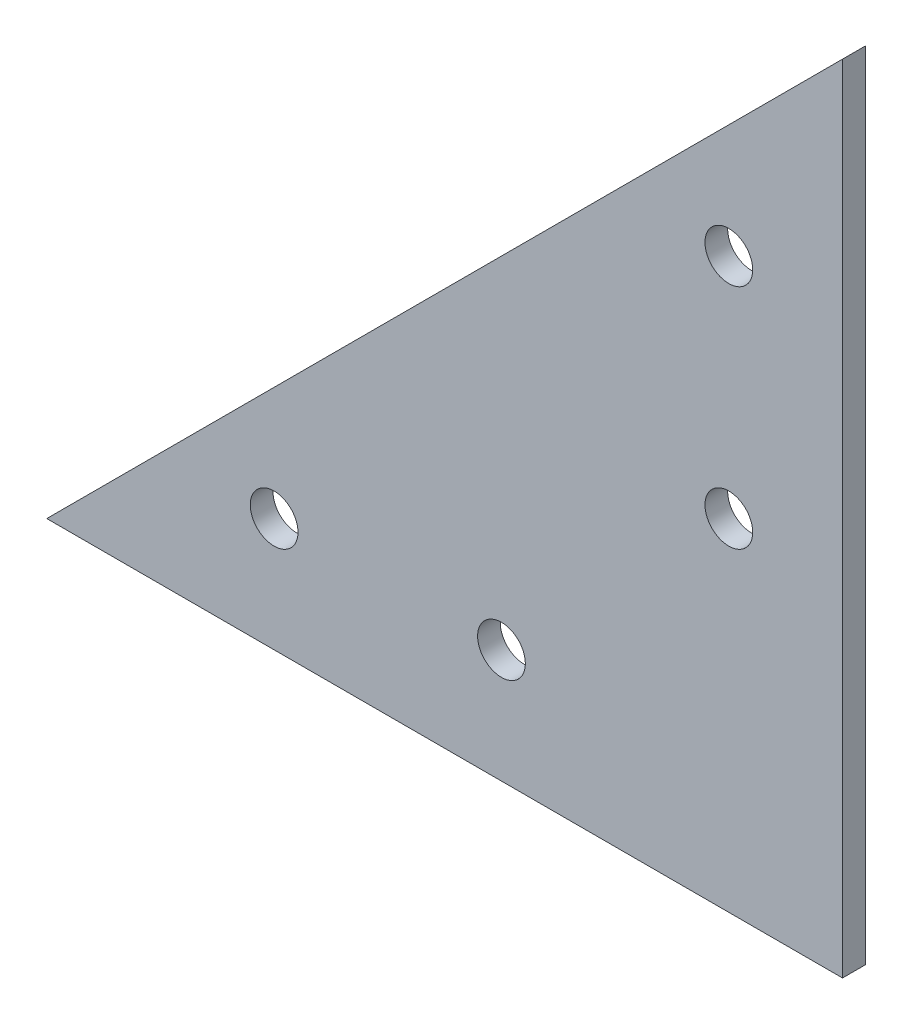
ISO-10303-21;
HEADER;
FILE_DESCRIPTION(('STEP AP214'),'2;1');
FILE_NAME('part.step','',(''),(''),'','','');
FILE_SCHEMA(('AUTOMOTIVE_DESIGN { 1 0 10303 214 1 1 1 1 }'));
ENDSEC;
DATA;
#1=APPLICATION_CONTEXT('core data for automotive mechanical design processes');
#2=APPLICATION_PROTOCOL_DEFINITION('international standard','automotive_design',2000,#1);
#3=PRODUCT_CONTEXT('',#1,'mechanical');
#4=PRODUCT('Part','Part','',(#3));
#5=PRODUCT_RELATED_PRODUCT_CATEGORY('part','',(#4));
#6=PRODUCT_DEFINITION_FORMATION('','',#4);
#7=PRODUCT_DEFINITION_CONTEXT('part definition',#1,'design');
#8=PRODUCT_DEFINITION('design','',#6,#7);
#9=PRODUCT_DEFINITION_SHAPE('','',#8);
#10=(LENGTH_UNIT() NAMED_UNIT(*) SI_UNIT(.MILLI.,.METRE.));
#11=(NAMED_UNIT(*) PLANE_ANGLE_UNIT() SI_UNIT($,.RADIAN.));
#12=(NAMED_UNIT(*) SI_UNIT($,.STERADIAN.) SOLID_ANGLE_UNIT());
#13=UNCERTAINTY_MEASURE_WITH_UNIT(LENGTH_MEASURE(1.E-05),#10,'distance_accuracy_value','');
#14=(GEOMETRIC_REPRESENTATION_CONTEXT(3) GLOBAL_UNCERTAINTY_ASSIGNED_CONTEXT((#13)) GLOBAL_UNIT_ASSIGNED_CONTEXT((#10,
#11,#12)) REPRESENTATION_CONTEXT('',''));
#15=CARTESIAN_POINT('',(0.,0.,0.));
#16=DIRECTION('',(0.,0.,1.));
#17=DIRECTION('',(1.,0.,0.));
#18=AXIS2_PLACEMENT_3D('',#15,#16,#17);
#19=CARTESIAN_POINT('',(0.,0.,2.));
#20=DIRECTION('',(0.,1.,0.));
#21=DIRECTION('',(0.,0.,1.));
#22=AXIS2_PLACEMENT_3D('',#19,#20,#21);
#23=PLANE('',#22);
#24=DIRECTION('',(1.,0.,0.));
#25=VECTOR('',#24,1.);
#26=CARTESIAN_POINT('',(0.,0.,0.));
#27=LINE('',#26,#25);
#28=CARTESIAN_POINT('',(-70.,0.,0.));
#29=VERTEX_POINT('',#28);
#30=CARTESIAN_POINT('',(0.,0.,0.));
#31=VERTEX_POINT('',#30);
#32=EDGE_CURVE('E83',#29,#31,#27,.T.);
#33=ORIENTED_EDGE('',*,*,#32,.T.);
#34=DIRECTION('',(0.,0.,-1.));
#35=VECTOR('',#34,1.);
#36=CARTESIAN_POINT('',(0.,0.,2.));
#37=LINE('',#36,#35);
#38=CARTESIAN_POINT('',(0.,0.,2.));
#39=VERTEX_POINT('',#38);
#40=EDGE_CURVE('E11',#39,#31,#37,.T.);
#41=ORIENTED_EDGE('',*,*,#40,.F.);
#42=DIRECTION('',(1.,0.,0.));
#43=VECTOR('',#42,1.);
#44=CARTESIAN_POINT('',(0.,0.,2.));
#45=LINE('',#44,#43);
#46=CARTESIAN_POINT('',(-70.,0.,2.));
#47=VERTEX_POINT('',#46);
#48=EDGE_CURVE('E75',#47,#39,#45,.T.);
#49=ORIENTED_EDGE('',*,*,#48,.F.);
#50=DIRECTION('',(0.,0.,-1.));
#51=VECTOR('',#50,1.);
#52=CARTESIAN_POINT('',(-70.,0.,2.));
#53=LINE('',#52,#51);
#54=EDGE_CURVE('E84',#47,#29,#53,.T.);
#55=ORIENTED_EDGE('',*,*,#54,.T.);
#56=EDGE_LOOP('',(#33,#41,#49,#55));
#57=FACE_BOUND('',#56,.T.);
#58=ADVANCED_FACE('F34',(#57),#23,.F.);
#59=CARTESIAN_POINT('',(0.,0.,2.));
#60=DIRECTION('',(-1.,0.,0.));
#61=DIRECTION('',(0.,0.,1.));
#62=AXIS2_PLACEMENT_3D('',#59,#60,#61);
#63=PLANE('',#62);
#64=DIRECTION('',(0.,1.,0.));
#65=VECTOR('',#64,1.);
#66=CARTESIAN_POINT('',(0.,0.,0.));
#67=LINE('',#66,#65);
#68=CARTESIAN_POINT('',(0.,70.,0.));
#69=VERTEX_POINT('',#68);
#70=EDGE_CURVE('E63',#31,#69,#67,.T.);
#71=ORIENTED_EDGE('',*,*,#70,.T.);
#72=DIRECTION('',(0.,0.,-1.));
#73=VECTOR('',#72,1.);
#74=CARTESIAN_POINT('',(0.,70.,2.));
#75=LINE('',#74,#73);
#76=CARTESIAN_POINT('',(0.,70.,2.));
#77=VERTEX_POINT('',#76);
#78=EDGE_CURVE('E43',#77,#69,#75,.T.);
#79=ORIENTED_EDGE('',*,*,#78,.F.);
#80=DIRECTION('',(0.,1.,0.));
#81=VECTOR('',#80,1.);
#82=CARTESIAN_POINT('',(0.,0.,2.));
#83=LINE('',#82,#81);
#84=EDGE_CURVE('E71',#39,#77,#83,.T.);
#85=ORIENTED_EDGE('',*,*,#84,.F.);
#86=ORIENTED_EDGE('',*,*,#40,.T.);
#87=EDGE_LOOP('',(#71,#79,#85,#86));
#88=FACE_BOUND('',#87,.T.);
#89=ADVANCED_FACE('F72',(#88),#63,.F.);
#90=CARTESIAN_POINT('',(-50.,9.99999999999999,2.));
#91=DIRECTION('',(0.,0.,-1.));
#92=DIRECTION('',(-1.,0.,0.));
#93=AXIS2_PLACEMENT_3D('',#90,#91,#92);
#94=CYLINDRICAL_SURFACE('',#93,2.1);
#95=CARTESIAN_POINT('',(-50.,9.99999999999999,2.));
#96=DIRECTION('',(0.,0.,1.));
#97=DIRECTION('',(1.,0.,0.));
#98=AXIS2_PLACEMENT_3D('',#95,#96,#97);
#99=CIRCLE('',#98,2.1);
#100=CARTESIAN_POINT('',(-47.9,9.99999999999999,2.));
#101=VERTEX_POINT('',#100);
#102=EDGE_CURVE('E80',#101,#101,#99,.T.);
#103=ORIENTED_EDGE('',*,*,#102,.T.);
#104=EDGE_LOOP('',(#103));
#105=FACE_BOUND('',#104,.T.);
#106=CARTESIAN_POINT('',(-50.,9.99999999999999,0.));
#107=DIRECTION('',(0.,0.,1.));
#108=DIRECTION('',(1.,0.,0.));
#109=AXIS2_PLACEMENT_3D('',#106,#107,#108);
#110=CIRCLE('',#109,2.1);
#111=CARTESIAN_POINT('',(-47.9,9.99999999999999,0.));
#112=VERTEX_POINT('',#111);
#113=EDGE_CURVE('E86',#112,#112,#110,.T.);
#114=ORIENTED_EDGE('',*,*,#113,.F.);
#115=EDGE_LOOP('',(#114));
#116=FACE_BOUND('',#115,.T.);
#117=ADVANCED_FACE('F114',(#105,#116),#94,.F.);
#118=CARTESIAN_POINT('',(-10.,50.,2.));
#119=DIRECTION('',(0.,0.,-1.));
#120=DIRECTION('',(-1.,0.,0.));
#121=AXIS2_PLACEMENT_3D('',#118,#119,#120);
#122=CYLINDRICAL_SURFACE('',#121,2.1);
#123=CARTESIAN_POINT('',(-10.,50.,2.));
#124=DIRECTION('',(0.,0.,1.));
#125=DIRECTION('',(1.,0.,0.));
#126=AXIS2_PLACEMENT_3D('',#123,#124,#125);
#127=CIRCLE('',#126,2.1);
#128=CARTESIAN_POINT('',(-7.9,50.,2.));
#129=VERTEX_POINT('',#128);
#130=EDGE_CURVE('E145',#129,#129,#127,.T.);
#131=ORIENTED_EDGE('',*,*,#130,.T.);
#132=EDGE_LOOP('',(#131));
#133=FACE_BOUND('',#132,.T.);
#134=CARTESIAN_POINT('',(-10.,50.,0.));
#135=DIRECTION('',(0.,0.,1.));
#136=DIRECTION('',(1.,0.,0.));
#137=AXIS2_PLACEMENT_3D('',#134,#135,#136);
#138=CIRCLE('',#137,2.1);
#139=CARTESIAN_POINT('',(-7.9,50.,0.));
#140=VERTEX_POINT('',#139);
#141=EDGE_CURVE('E90',#140,#140,#138,.T.);
#142=ORIENTED_EDGE('',*,*,#141,.F.);
#143=EDGE_LOOP('',(#142));
#144=FACE_BOUND('',#143,.T.);
#145=ADVANCED_FACE('F119',(#133,#144),#122,.F.);
#146=CARTESIAN_POINT('',(-10.,30.,2.));
#147=DIRECTION('',(0.,0.,-1.));
#148=DIRECTION('',(-1.,0.,0.));
#149=AXIS2_PLACEMENT_3D('',#146,#147,#148);
#150=CYLINDRICAL_SURFACE('',#149,2.1);
#151=CARTESIAN_POINT('',(-10.,30.,2.));
#152=DIRECTION('',(0.,0.,1.));
#153=DIRECTION('',(1.,0.,0.));
#154=AXIS2_PLACEMENT_3D('',#151,#152,#153);
#155=CIRCLE('',#154,2.1);
#156=CARTESIAN_POINT('',(-7.9,30.,2.));
#157=VERTEX_POINT('',#156);
#158=EDGE_CURVE('E133',#157,#157,#155,.T.);
#159=ORIENTED_EDGE('',*,*,#158,.T.);
#160=EDGE_LOOP('',(#159));
#161=FACE_BOUND('',#160,.T.);
#162=CARTESIAN_POINT('',(-10.,30.,0.));
#163=DIRECTION('',(0.,0.,1.));
#164=DIRECTION('',(1.,0.,0.));
#165=AXIS2_PLACEMENT_3D('',#162,#163,#164);
#166=CIRCLE('',#165,2.1);
#167=CARTESIAN_POINT('',(-7.9,30.,0.));
#168=VERTEX_POINT('',#167);
#169=EDGE_CURVE('E136',#168,#168,#166,.T.);
#170=ORIENTED_EDGE('',*,*,#169,.F.);
#171=EDGE_LOOP('',(#170));
#172=FACE_BOUND('',#171,.T.);
#173=ADVANCED_FACE('F122',(#161,#172),#150,.F.);
#174=CARTESIAN_POINT('',(-30.,9.99999999999999,2.));
#175=DIRECTION('',(0.,0.,-1.));
#176=DIRECTION('',(-1.,0.,0.));
#177=AXIS2_PLACEMENT_3D('',#174,#175,#176);
#178=CYLINDRICAL_SURFACE('',#177,2.1);
#179=CARTESIAN_POINT('',(-30.,9.99999999999999,2.));
#180=DIRECTION('',(0.,0.,1.));
#181=DIRECTION('',(1.,0.,0.));
#182=AXIS2_PLACEMENT_3D('',#179,#180,#181);
#183=CIRCLE('',#182,2.1);
#184=CARTESIAN_POINT('',(-27.9,9.99999999999999,2.));
#185=VERTEX_POINT('',#184);
#186=EDGE_CURVE('E95',#185,#185,#183,.T.);
#187=ORIENTED_EDGE('',*,*,#186,.T.);
#188=EDGE_LOOP('',(#187));
#189=FACE_BOUND('',#188,.T.);
#190=CARTESIAN_POINT('',(-30.,9.99999999999999,0.));
#191=DIRECTION('',(0.,0.,1.));
#192=DIRECTION('',(1.,0.,0.));
#193=AXIS2_PLACEMENT_3D('',#190,#191,#192);
#194=CIRCLE('',#193,2.1);
#195=CARTESIAN_POINT('',(-27.9,9.99999999999999,0.));
#196=VERTEX_POINT('',#195);
#197=EDGE_CURVE('E137',#196,#196,#194,.T.);
#198=ORIENTED_EDGE('',*,*,#197,.F.);
#199=EDGE_LOOP('',(#198));
#200=FACE_BOUND('',#199,.T.);
#201=ADVANCED_FACE('F36',(#189,#200),#178,.F.);
#202=CARTESIAN_POINT('',(-35.,35.,2.));
#203=DIRECTION('',(0.707106781186547,-0.707106781186547,0.));
#204=DIRECTION('',(0.707106781186548,0.707106781186548,0.));
#205=AXIS2_PLACEMENT_3D('',#202,#203,#204);
#206=PLANE('',#205);
#207=DIRECTION('',(-0.707106781186548,-0.707106781186548,0.));
#208=VECTOR('',#207,1.);
#209=CARTESIAN_POINT('',(-35.,35.,0.));
#210=LINE('',#209,#208);
#211=EDGE_CURVE('E68',#69,#29,#210,.T.);
#212=ORIENTED_EDGE('',*,*,#211,.T.);
#213=ORIENTED_EDGE('',*,*,#54,.F.);
#214=DIRECTION('',(-0.707106781186548,-0.707106781186548,0.));
#215=VECTOR('',#214,1.);
#216=CARTESIAN_POINT('',(-35.,35.,2.));
#217=LINE('',#216,#215);
#218=EDGE_CURVE('E51',#77,#47,#217,.T.);
#219=ORIENTED_EDGE('',*,*,#218,.F.);
#220=ORIENTED_EDGE('',*,*,#78,.T.);
#221=EDGE_LOOP('',(#212,#213,#219,#220));
#222=FACE_BOUND('',#221,.T.);
#223=ADVANCED_FACE('F96',(#222),#206,.F.);
#224=CARTESIAN_POINT('',(0.,0.,2.));
#225=DIRECTION('',(0.,0.,1.));
#226=DIRECTION('',(1.,0.,0.));
#227=AXIS2_PLACEMENT_3D('',#224,#225,#226);
#228=PLANE('',#227);
#229=ORIENTED_EDGE('',*,*,#186,.F.);
#230=EDGE_LOOP('',(#229));
#231=FACE_BOUND('',#230,.T.);
#232=ORIENTED_EDGE('',*,*,#158,.F.);
#233=EDGE_LOOP('',(#232));
#234=FACE_BOUND('',#233,.T.);
#235=ORIENTED_EDGE('',*,*,#130,.F.);
#236=EDGE_LOOP('',(#235));
#237=FACE_BOUND('',#236,.T.);
#238=ORIENTED_EDGE('',*,*,#102,.F.);
#239=EDGE_LOOP('',(#238));
#240=FACE_BOUND('',#239,.T.);
#241=ORIENTED_EDGE('',*,*,#48,.T.);
#242=ORIENTED_EDGE('',*,*,#84,.T.);
#243=ORIENTED_EDGE('',*,*,#218,.T.);
#244=EDGE_LOOP('',(#241,#242,#243));
#245=FACE_BOUND('',#244,.T.);
#246=ADVANCED_FACE('F78',(#231,#234,#237,#240,#245),#228,.T.);
#247=CARTESIAN_POINT('',(0.,0.,0.));
#248=DIRECTION('',(0.,0.,1.));
#249=DIRECTION('',(1.,0.,0.));
#250=AXIS2_PLACEMENT_3D('',#247,#248,#249);
#251=PLANE('',#250);
#252=ORIENTED_EDGE('',*,*,#197,.T.);
#253=EDGE_LOOP('',(#252));
#254=FACE_BOUND('',#253,.T.);
#255=ORIENTED_EDGE('',*,*,#169,.T.);
#256=EDGE_LOOP('',(#255));
#257=FACE_BOUND('',#256,.T.);
#258=ORIENTED_EDGE('',*,*,#141,.T.);
#259=EDGE_LOOP('',(#258));
#260=FACE_BOUND('',#259,.T.);
#261=ORIENTED_EDGE('',*,*,#113,.T.);
#262=EDGE_LOOP('',(#261));
#263=FACE_BOUND('',#262,.T.);
#264=ORIENTED_EDGE('',*,*,#32,.F.);
#265=ORIENTED_EDGE('',*,*,#211,.F.);
#266=ORIENTED_EDGE('',*,*,#70,.F.);
#267=EDGE_LOOP('',(#264,#265,#266));
#268=FACE_BOUND('',#267,.T.);
#269=ADVANCED_FACE('F97',(#254,#257,#260,#263,#268),#251,.F.);
#270=CLOSED_SHELL('',(#58,#89,#117,#145,#173,#201,#223,#246,#269));
#271=MANIFOLD_SOLID_BREP('B2',#270);
#272=ADVANCED_BREP_SHAPE_REPRESENTATION('',(#18,#271),#14);
#273=SHAPE_DEFINITION_REPRESENTATION(#9,#272);
ENDSEC;
END-ISO-10303-21;
